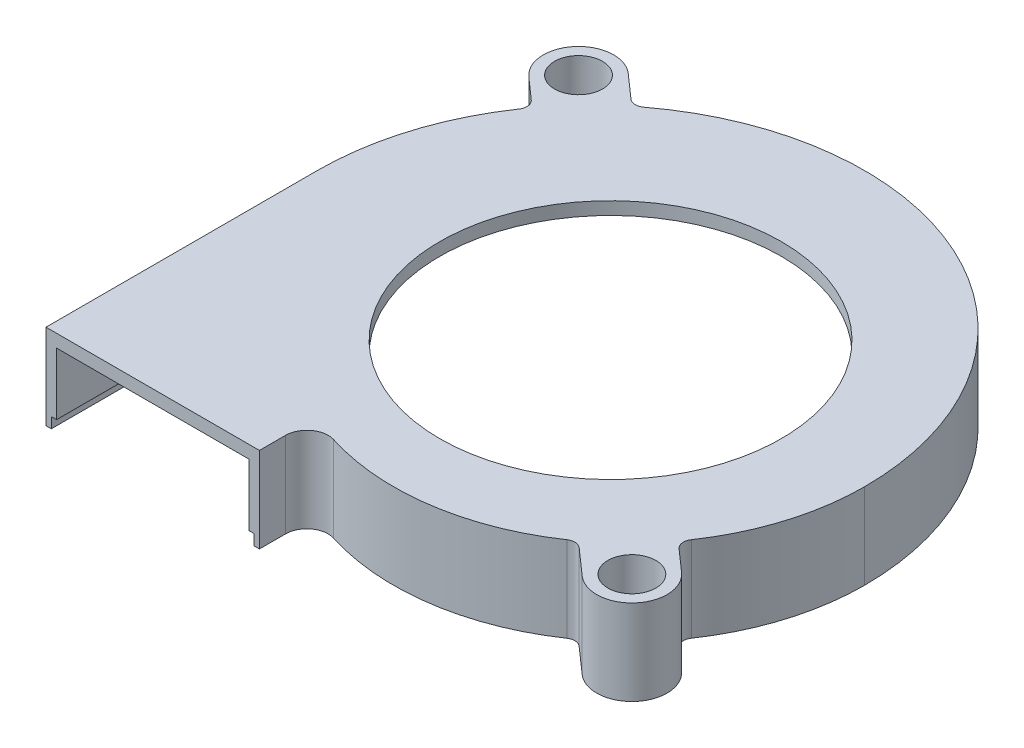
ISO-10303-21;
HEADER;
FILE_DESCRIPTION(('STEP AP214'),'2;1');
FILE_NAME('part.step','',(''),(''),'','','');
FILE_SCHEMA(('AUTOMOTIVE_DESIGN { 1 0 10303 214 1 1 1 1 }'));
ENDSEC;
DATA;
#1=APPLICATION_CONTEXT('core data for automotive mechanical design processes');
#2=APPLICATION_PROTOCOL_DEFINITION('international standard','automotive_design',2000,#1);
#3=PRODUCT_CONTEXT('',#1,'mechanical');
#4=PRODUCT('Part','Part','',(#3));
#5=PRODUCT_RELATED_PRODUCT_CATEGORY('part','',(#4));
#6=PRODUCT_DEFINITION_FORMATION('','',#4);
#7=PRODUCT_DEFINITION_CONTEXT('part definition',#1,'design');
#8=PRODUCT_DEFINITION('design','',#6,#7);
#9=PRODUCT_DEFINITION_SHAPE('','',#8);
#10=(LENGTH_UNIT() NAMED_UNIT(*) SI_UNIT(.MILLI.,.METRE.));
#11=(NAMED_UNIT(*) PLANE_ANGLE_UNIT() SI_UNIT($,.RADIAN.));
#12=(NAMED_UNIT(*) SI_UNIT($,.STERADIAN.) SOLID_ANGLE_UNIT());
#13=UNCERTAINTY_MEASURE_WITH_UNIT(LENGTH_MEASURE(1.E-05),#10,'distance_accuracy_value','');
#14=(GEOMETRIC_REPRESENTATION_CONTEXT(3) GLOBAL_UNCERTAINTY_ASSIGNED_CONTEXT((#13)) GLOBAL_UNIT_ASSIGNED_CONTEXT((#10,
#11,#12)) REPRESENTATION_CONTEXT('',''));
#15=CARTESIAN_POINT('',(0.,0.,0.));
#16=DIRECTION('',(0.,0.,1.));
#17=DIRECTION('',(1.,0.,0.));
#18=AXIS2_PLACEMENT_3D('',#15,#16,#17);
#19=CARTESIAN_POINT('',(-8.5,70.26503959981,25.4));
#20=DIRECTION('',(1.,0.,0.));
#21=DIRECTION('',(0.,0.,-1.));
#22=AXIS2_PLACEMENT_3D('',#19,#20,#21);
#23=PLANE('',#22);
#24=DIRECTION('',(0.,0.,-1.));
#25=VECTOR('',#24,1.);
#26=CARTESIAN_POINT('',(-8.5,-7.,22.9558491109208));
#27=LINE('',#26,#25);
#28=CARTESIAN_POINT('',(-8.5,-7.,25.4));
#29=VERTEX_POINT('',#28);
#30=CARTESIAN_POINT('',(-8.5,-7.,22.9558491109208));
#31=VERTEX_POINT('',#30);
#32=EDGE_CURVE('E587',#29,#31,#27,.T.);
#33=ORIENTED_EDGE('',*,*,#32,.F.);
#34=DIRECTION('',(0.,-1.,0.));
#35=VECTOR('',#34,1.);
#36=CARTESIAN_POINT('',(-8.5,70.26503959981,25.4));
#37=LINE('',#36,#35);
#38=CARTESIAN_POINT('',(-8.5,-1.20000000000001,25.4));
#39=VERTEX_POINT('',#38);
#40=EDGE_CURVE('E498',#39,#29,#37,.T.);
#41=ORIENTED_EDGE('',*,*,#40,.F.);
#42=DIRECTION('',(0.,0.,-1.));
#43=VECTOR('',#42,1.);
#44=CARTESIAN_POINT('',(-8.5,-1.20000000000001,25.4));
#45=LINE('',#44,#43);
#46=CARTESIAN_POINT('',(-8.49999999999999,-1.20000000000001,22.9558491109208));
#47=VERTEX_POINT('',#46);
#48=EDGE_CURVE('E590',#39,#47,#45,.T.);
#49=ORIENTED_EDGE('',*,*,#48,.T.);
#50=DIRECTION('',(0.,-1.,0.));
#51=VECTOR('',#50,1.);
#52=CARTESIAN_POINT('',(-8.5,70.26503959981,22.9558491109208));
#53=LINE('',#52,#51);
#54=EDGE_CURVE('E502',#47,#31,#53,.T.);
#55=ORIENTED_EDGE('',*,*,#54,.T.);
#56=EDGE_LOOP('',(#33,#41,#49,#55));
#57=FACE_BOUND('',#56,.T.);
#58=ADVANCED_FACE('F38',(#57),#23,.F.);
#59=CARTESIAN_POINT('',(-5.5,70.26503959981,22.9558491109208));
#60=DIRECTION('',(0.,-1.,0.));
#61=DIRECTION('',(0.,0.,-1.));
#62=AXIS2_PLACEMENT_3D('',#59,#60,#61);
#63=CYLINDRICAL_SURFACE('',#62,3.);
#64=CARTESIAN_POINT('',(-5.5,-7.,22.9558491109208));
#65=DIRECTION('',(0.,-1.,0.));
#66=DIRECTION('',(0.,0.,-1.));
#67=AXIS2_PLACEMENT_3D('',#64,#65,#66);
#68=CIRCLE('',#67,3.);
#69=CARTESIAN_POINT('',(-4.5985649942554,-7.,20.0944831905794));
#70=VERTEX_POINT('',#69);
#71=EDGE_CURVE('E576',#31,#70,#68,.T.);
#72=ORIENTED_EDGE('',*,*,#71,.F.);
#73=ORIENTED_EDGE('',*,*,#54,.F.);
#74=CARTESIAN_POINT('',(-5.5,-1.20000000000001,22.9558491109208));
#75=DIRECTION('',(0.,-1.,0.));
#76=DIRECTION('',(0.,0.,-1.));
#77=AXIS2_PLACEMENT_3D('',#74,#75,#76);
#78=CIRCLE('',#77,3.);
#79=CARTESIAN_POINT('',(-4.59856499423902,-1.20000000000001,20.0944831905274));
#80=VERTEX_POINT('',#79);
#81=EDGE_CURVE('E489',#47,#80,#78,.T.);
#82=ORIENTED_EDGE('',*,*,#81,.T.);
#83=DIRECTION('',(0.,-1.,0.));
#84=VECTOR('',#83,1.);
#85=CARTESIAN_POINT('',(-4.59856499423902,70.26503959981,20.0944831905274));
#86=LINE('',#85,#84);
#87=EDGE_CURVE('E486',#80,#70,#86,.T.);
#88=ORIENTED_EDGE('',*,*,#87,.T.);
#89=EDGE_LOOP('',(#72,#73,#82,#88));
#90=FACE_BOUND('',#89,.T.);
#91=ADVANCED_FACE('F307',(#90),#63,.T.);
#92=CARTESIAN_POINT('',(1.73193277310925,70.26503959981,0.));
#93=DIRECTION('',(0.,-1.,0.));
#94=DIRECTION('',(0.,0.,-1.));
#95=AXIS2_PLACEMENT_3D('',#92,#93,#94);
#96=CYLINDRICAL_SURFACE('',#95,21.0680672268908);
#97=CARTESIAN_POINT('',(1.73193277310925,-7.,0.));
#98=DIRECTION('',(0.,1.,0.));
#99=DIRECTION('',(0.,0.,-1.));
#100=AXIS2_PLACEMENT_3D('',#97,#98,#99);
#101=CIRCLE('',#100,21.0680672269453);
#102=CARTESIAN_POINT('',(22.800000024916,-7.,-0.000327043078988983));
#103=VERTEX_POINT('',#102);
#104=EDGE_CURVE('E603',#70,#103,#101,.T.);
#105=ORIENTED_EDGE('',*,*,#104,.F.);
#106=ORIENTED_EDGE('',*,*,#87,.F.);
#107=CARTESIAN_POINT('',(1.73193277310925,-1.20000000000001,0.));
#108=DIRECTION('',(0.,-1.,0.));
#109=DIRECTION('',(0.,0.,-1.));
#110=AXIS2_PLACEMENT_3D('',#107,#108,#109);
#111=CIRCLE('',#110,21.0680672268908);
#112=CARTESIAN_POINT('',(22.7999999974641,-1.20000000000001,-0.000326883642031274));
#113=VERTEX_POINT('',#112);
#114=EDGE_CURVE('E480',#80,#113,#111,.F.);
#115=ORIENTED_EDGE('',*,*,#114,.T.);
#116=DIRECTION('',(0.,-1.,0.));
#117=VECTOR('',#116,1.);
#118=CARTESIAN_POINT('',(22.7999999974641,70.26503959981,-0.000326883642031271));
#119=LINE('',#118,#117);
#120=EDGE_CURVE('E484',#113,#103,#119,.T.);
#121=ORIENTED_EDGE('',*,*,#120,.T.);
#122=EDGE_LOOP('',(#105,#106,#115,#121));
#123=FACE_BOUND('',#122,.T.);
#124=ADVANCED_FACE('F313',(#123),#96,.F.);
#125=CARTESIAN_POINT('',(-1.85,70.26503959981,-0.016796874999999));
#126=DIRECTION('',(0.,-1.,0.));
#127=DIRECTION('',(0.,0.,-1.));
#128=AXIS2_PLACEMENT_3D('',#125,#126,#127);
#129=CYLINDRICAL_SURFACE('',#128,24.6500054997072);
#130=CARTESIAN_POINT('',(-1.85,-7.,-0.016796874999999));
#131=DIRECTION('',(0.,1.,0.));
#132=DIRECTION('',(0.,0.,-1.));
#133=AXIS2_PLACEMENT_3D('',#130,#131,#132);
#134=CIRCLE('',#133,24.6500055270525);
#135=CARTESIAN_POINT('',(-26.5000000525161,-7.00000000000001,-0.000327424430267257));
#136=VERTEX_POINT('',#135);
#137=EDGE_CURVE('E55',#103,#136,#134,.T.);
#138=ORIENTED_EDGE('',*,*,#137,.F.);
#139=ORIENTED_EDGE('',*,*,#120,.F.);
#140=CARTESIAN_POINT('',(-1.85,-1.20000000000001,-0.016796874999999));
#141=DIRECTION('',(0.,-1.,0.));
#142=DIRECTION('',(0.,0.,-1.));
#143=AXIS2_PLACEMENT_3D('',#140,#141,#142);
#144=CIRCLE('',#143,24.6500054997072);
#145=CARTESIAN_POINT('',(-26.5000000525161,-1.20000000000001,-0.000327424430267257));
#146=VERTEX_POINT('',#145);
#147=EDGE_CURVE('E490',#113,#146,#144,.F.);
#148=ORIENTED_EDGE('',*,*,#147,.T.);
#149=DIRECTION('',(0.,-1.,0.));
#150=VECTOR('',#149,1.);
#151=CARTESIAN_POINT('',(-26.5000000525161,70.26503959981,-0.000327424430267257));
#152=LINE('',#151,#150);
#153=EDGE_CURVE('E500',#146,#136,#152,.T.);
#154=ORIENTED_EDGE('',*,*,#153,.T.);
#155=EDGE_LOOP('',(#138,#139,#148,#154));
#156=FACE_BOUND('',#155,.T.);
#157=ADVANCED_FACE('F323',(#156),#129,.F.);
#158=CARTESIAN_POINT('',(-26.5000001072067,70.26503959981,-0.000327424393735107));
#159=DIRECTION('',(-1.,0.,4.22068338812948E-09));
#160=DIRECTION('',(4.22068338812948E-09,0.,1.));
#161=AXIS2_PLACEMENT_3D('',#158,#159,#160);
#162=PLANE('',#161);
#163=DIRECTION('',(-4.28055939719574E-11,0.,1.));
#164=VECTOR('',#163,1.);
#165=CARTESIAN_POINT('',(-26.5000000536034,-7.,25.4));
#166=LINE('',#165,#164);
#167=CARTESIAN_POINT('',(-26.5000000536034,-7.,25.4));
#168=VERTEX_POINT('',#167);
#169=EDGE_CURVE('E608',#136,#168,#166,.T.);
#170=ORIENTED_EDGE('',*,*,#169,.F.);
#171=ORIENTED_EDGE('',*,*,#153,.F.);
#172=DIRECTION('',(4.22068338812948E-09,0.,1.));
#173=VECTOR('',#172,1.);
#174=CARTESIAN_POINT('',(-26.5000001072067,-1.20000000000001,-0.000327424393735107));
#175=LINE('',#174,#173);
#176=CARTESIAN_POINT('',(-26.5,-1.20000000000001,25.4));
#177=VERTEX_POINT('',#176);
#178=EDGE_CURVE('E495',#146,#177,#175,.T.);
#179=ORIENTED_EDGE('',*,*,#178,.T.);
#180=DIRECTION('',(0.,-1.,0.));
#181=VECTOR('',#180,1.);
#182=CARTESIAN_POINT('',(-26.5,70.26503959981,25.4));
#183=LINE('',#182,#181);
#184=EDGE_CURVE('E504',#177,#168,#183,.T.);
#185=ORIENTED_EDGE('',*,*,#184,.T.);
#186=EDGE_LOOP('',(#170,#171,#179,#185));
#187=FACE_BOUND('',#186,.T.);
#188=ADVANCED_FACE('F327',(#187),#162,.F.);
#189=CARTESIAN_POINT('',(0.,-8.,0.));
#190=DIRECTION('',(0.,1.,0.));
#191=DIRECTION('',(0.,0.,1.));
#192=AXIS2_PLACEMENT_3D('',#189,#190,#191);
#193=CYLINDRICAL_SURFACE('',#192,16.);
#194=CARTESIAN_POINT('',(0.,0.,0.));
#195=DIRECTION('',(0.,1.,0.));
#196=DIRECTION('',(0.,0.,1.));
#197=AXIS2_PLACEMENT_3D('',#194,#195,#196);
#198=CIRCLE('',#197,16.);
#199=CARTESIAN_POINT('',(0.,0.,16.));
#200=VERTEX_POINT('',#199);
#201=EDGE_CURVE('E351',#200,#200,#198,.T.);
#202=ORIENTED_EDGE('',*,*,#201,.T.);
#203=EDGE_LOOP('',(#202));
#204=FACE_BOUND('',#203,.T.);
#205=CARTESIAN_POINT('',(0.,-1.2,0.));
#206=DIRECTION('',(0.,-1.,0.));
#207=DIRECTION('',(0.,0.,-1.));
#208=AXIS2_PLACEMENT_3D('',#205,#206,#207);
#209=CIRCLE('',#208,16.);
#210=CARTESIAN_POINT('',(0.,-1.2,-16.));
#211=VERTEX_POINT('',#210);
#212=EDGE_CURVE('E42',#211,#211,#209,.F.);
#213=ORIENTED_EDGE('',*,*,#212,.F.);
#214=EDGE_LOOP('',(#213));
#215=FACE_BOUND('',#214,.T.);
#216=ADVANCED_FACE('F304',(#204,#215),#193,.F.);
#217=CARTESIAN_POINT('',(-23.,-8.,-20.));
#218=DIRECTION('',(0.,1.,0.));
#219=DIRECTION('',(0.,0.,1.));
#220=AXIS2_PLACEMENT_3D('',#217,#218,#219);
#221=CYLINDRICAL_SURFACE('',#220,3.3);
#222=CARTESIAN_POINT('',(-23.,0.,-20.));
#223=DIRECTION('',(0.,1.,0.));
#224=DIRECTION('',(0.,0.,-1.));
#225=AXIS2_PLACEMENT_3D('',#222,#223,#224);
#226=CIRCLE('',#225,3.3);
#227=CARTESIAN_POINT('',(-20.8147472716434,0.,-22.4727859820878));
#228=VERTEX_POINT('',#227);
#229=CARTESIAN_POINT('',(-25.1852527283566,0.,-17.5272140179122));
#230=VERTEX_POINT('',#229);
#231=EDGE_CURVE('E212',#228,#230,#226,.T.);
#232=ORIENTED_EDGE('',*,*,#231,.F.);
#233=DIRECTION('',(0.,1.,0.));
#234=VECTOR('',#233,1.);
#235=CARTESIAN_POINT('',(-20.8147472716434,-8.,-22.4727859820878));
#236=LINE('',#235,#234);
#237=CARTESIAN_POINT('',(-20.8147472716434,-8.,-22.4727859820878));
#238=VERTEX_POINT('',#237);
#239=EDGE_CURVE('E12',#238,#228,#236,.T.);
#240=ORIENTED_EDGE('',*,*,#239,.F.);
#241=CARTESIAN_POINT('',(-23.,-8.,-20.));
#242=DIRECTION('',(0.,1.,0.));
#243=DIRECTION('',(0.,0.,-1.));
#244=AXIS2_PLACEMENT_3D('',#241,#242,#243);
#245=CIRCLE('',#244,3.3);
#246=CARTESIAN_POINT('',(-25.1852527283566,-8.,-17.5272140179122));
#247=VERTEX_POINT('',#246);
#248=EDGE_CURVE('E263',#238,#247,#245,.T.);
#249=ORIENTED_EDGE('',*,*,#248,.T.);
#250=DIRECTION('',(0.,1.,0.));
#251=VECTOR('',#250,1.);
#252=CARTESIAN_POINT('',(-25.1852527283566,-8.,-17.5272140179122));
#253=LINE('',#252,#251);
#254=EDGE_CURVE('E131',#247,#230,#253,.T.);
#255=ORIENTED_EDGE('',*,*,#254,.T.);
#256=EDGE_LOOP('',(#232,#240,#249,#255));
#257=FACE_BOUND('',#256,.T.);
#258=ADVANCED_FACE('F40',(#257),#221,.T.);
#259=CARTESIAN_POINT('',(-20.8147472716434,-8.,-22.4727859820878));
#260=DIRECTION('',(0.66219779647171,0.,-0.749329085481147));
#261=DIRECTION('',(-0.749329085481147,0.,-0.66219779647171));
#262=AXIS2_PLACEMENT_3D('',#259,#260,#261);
#263=PLANE('',#262);
#264=DIRECTION('',(-0.749329085481147,0.,-0.66219779647171));
#265=VECTOR('',#264,1.);
#266=CARTESIAN_POINT('',(-20.8147472716434,0.,-22.4727859820878));
#267=LINE('',#266,#265);
#268=CARTESIAN_POINT('',(-18.5989053771657,0.,-20.5146001218517));
#269=VERTEX_POINT('',#268);
#270=EDGE_CURVE('E261',#269,#228,#267,.T.);
#271=ORIENTED_EDGE('',*,*,#270,.F.);
#272=DIRECTION('',(0.,1.,0.));
#273=VECTOR('',#272,1.);
#274=CARTESIAN_POINT('',(-18.5989053771657,-8.,-20.5146001218517));
#275=LINE('',#274,#273);
#276=CARTESIAN_POINT('',(-18.5989053771657,-8.,-20.5146001218517));
#277=VERTEX_POINT('',#276);
#278=EDGE_CURVE('E47',#277,#269,#275,.T.);
#279=ORIENTED_EDGE('',*,*,#278,.F.);
#280=DIRECTION('',(-0.749329085481147,0.,-0.66219779647171));
#281=VECTOR('',#280,1.);
#282=CARTESIAN_POINT('',(-20.8147472716434,-8.,-22.4727859820878));
#283=LINE('',#282,#281);
#284=EDGE_CURVE('E202',#277,#238,#283,.T.);
#285=ORIENTED_EDGE('',*,*,#284,.T.);
#286=ORIENTED_EDGE('',*,*,#239,.T.);
#287=EDGE_LOOP('',(#271,#279,#285,#286));
#288=FACE_BOUND('',#287,.T.);
#289=ADVANCED_FACE('F296',(#288),#263,.T.);
#290=CARTESIAN_POINT('',(-17.936707580694,-8.,-21.2639292073329));
#291=DIRECTION('',(0.,1.,0.));
#292=DIRECTION('',(0.,0.,1.));
#293=AXIS2_PLACEMENT_3D('',#290,#291,#292);
#294=CYLINDRICAL_SURFACE('',#293,1.);
#295=CARTESIAN_POINT('',(-17.936707580694,0.,-21.2639292073329));
#296=DIRECTION('',(0.,-1.,0.));
#297=DIRECTION('',(0.,0.,1.));
#298=AXIS2_PLACEMENT_3D('',#295,#296,#297);
#299=CIRCLE('',#298,1.);
#300=CARTESIAN_POINT('',(-17.3330789029862,0.,-20.4666636183045));
#301=VERTEX_POINT('',#300);
#302=EDGE_CURVE('E187',#301,#269,#299,.T.);
#303=ORIENTED_EDGE('',*,*,#302,.F.);
#304=DIRECTION('',(0.,1.,0.));
#305=VECTOR('',#304,1.);
#306=CARTESIAN_POINT('',(-17.3330789029862,-8.,-20.4666636183045));
#307=LINE('',#306,#305);
#308=CARTESIAN_POINT('',(-17.3330789029862,-8.,-20.4666636183045));
#309=VERTEX_POINT('',#308);
#310=EDGE_CURVE('E181',#309,#301,#307,.T.);
#311=ORIENTED_EDGE('',*,*,#310,.F.);
#312=CARTESIAN_POINT('',(-17.936707580694,-8.,-21.2639292073329));
#313=DIRECTION('',(0.,-1.,0.));
#314=DIRECTION('',(0.,0.,1.));
#315=AXIS2_PLACEMENT_3D('',#312,#313,#314);
#316=CIRCLE('',#315,1.);
#317=EDGE_CURVE('E184',#309,#277,#316,.T.);
#318=ORIENTED_EDGE('',*,*,#317,.T.);
#319=ORIENTED_EDGE('',*,*,#278,.T.);
#320=EDGE_LOOP('',(#303,#311,#318,#319));
#321=FACE_BOUND('',#320,.T.);
#322=ADVANCED_FACE('F183',(#321),#294,.F.);
#323=CARTESIAN_POINT('',(-1.85,-8.,-0.016796874999999));
#324=DIRECTION('',(0.,1.,0.));
#325=DIRECTION('',(0.,0.,1.));
#326=AXIS2_PLACEMENT_3D('',#323,#324,#325);
#327=CYLINDRICAL_SURFACE('',#326,25.6500054997072);
#328=CARTESIAN_POINT('',(-1.85,0.,-0.016796874999999));
#329=DIRECTION('',(0.,1.,0.));
#330=DIRECTION('',(0.,0.,1.));
#331=AXIS2_PLACEMENT_3D('',#328,#329,#330);
#332=CIRCLE('',#331,25.6500054997072);
#333=CARTESIAN_POINT('',(23.8,0.,0.));
#334=VERTEX_POINT('',#333);
#335=EDGE_CURVE('E258',#334,#301,#332,.T.);
#336=ORIENTED_EDGE('',*,*,#335,.F.);
#337=DIRECTION('',(0.,1.,0.));
#338=VECTOR('',#337,1.);
#339=CARTESIAN_POINT('',(23.8,-8.,0.));
#340=LINE('',#339,#338);
#341=CARTESIAN_POINT('',(23.8,-8.,0.));
#342=VERTEX_POINT('',#341);
#343=EDGE_CURVE('E192',#342,#334,#340,.T.);
#344=ORIENTED_EDGE('',*,*,#343,.F.);
#345=CARTESIAN_POINT('',(-1.85,-8.,-0.016796874999999));
#346=DIRECTION('',(0.,1.,0.));
#347=DIRECTION('',(0.,0.,1.));
#348=AXIS2_PLACEMENT_3D('',#345,#346,#347);
#349=CIRCLE('',#348,25.6500054997072);
#350=EDGE_CURVE('E200',#342,#309,#349,.T.);
#351=ORIENTED_EDGE('',*,*,#350,.T.);
#352=ORIENTED_EDGE('',*,*,#310,.T.);
#353=EDGE_LOOP('',(#336,#344,#351,#352));
#354=FACE_BOUND('',#353,.T.);
#355=ADVANCED_FACE('F204',(#354),#327,.T.);
#356=CARTESIAN_POINT('',(1.73193277310925,-8.,0.));
#357=DIRECTION('',(0.,1.,0.));
#358=DIRECTION('',(0.,0.,1.));
#359=AXIS2_PLACEMENT_3D('',#356,#357,#358);
#360=CYLINDRICAL_SURFACE('',#359,22.0680672268908);
#361=CARTESIAN_POINT('',(1.73193277310925,0.,0.));
#362=DIRECTION('',(0.,1.,0.));
#363=DIRECTION('',(0.,0.,-1.));
#364=AXIS2_PLACEMENT_3D('',#361,#362,#363);
#365=CIRCLE('',#364,22.0680672268908);
#366=CARTESIAN_POINT('',(19.9790752063348,0.,12.4113409489929));
#367=VERTEX_POINT('',#366);
#368=EDGE_CURVE('E255',#367,#334,#365,.T.);
#369=ORIENTED_EDGE('',*,*,#368,.F.);
#370=DIRECTION('',(0.,1.,0.));
#371=VECTOR('',#370,1.);
#372=CARTESIAN_POINT('',(19.9790752063348,-8.,12.4113409489929));
#373=LINE('',#372,#371);
#374=CARTESIAN_POINT('',(19.9790752063348,-8.,12.4113409489929));
#375=VERTEX_POINT('',#374);
#376=EDGE_CURVE('E267',#375,#367,#373,.T.);
#377=ORIENTED_EDGE('',*,*,#376,.F.);
#378=CARTESIAN_POINT('',(1.73193277310925,-8.,0.));
#379=DIRECTION('',(0.,1.,0.));
#380=DIRECTION('',(0.,0.,-1.));
#381=AXIS2_PLACEMENT_3D('',#378,#379,#380);
#382=CIRCLE('',#381,22.0680672268908);
#383=EDGE_CURVE('E205',#375,#342,#382,.T.);
#384=ORIENTED_EDGE('',*,*,#383,.T.);
#385=ORIENTED_EDGE('',*,*,#343,.T.);
#386=EDGE_LOOP('',(#369,#377,#384,#385));
#387=FACE_BOUND('',#386,.T.);
#388=ADVANCED_FACE('F666',(#387),#360,.T.);
#389=CARTESIAN_POINT('',(20.8059325040591,-8.,12.9737527280304));
#390=DIRECTION('',(0.,1.,0.));
#391=DIRECTION('',(0.,0.,1.));
#392=AXIS2_PLACEMENT_3D('',#389,#390,#391);
#393=CYLINDRICAL_SURFACE('',#392,1.);
#394=CARTESIAN_POINT('',(20.8059325040591,0.,12.9737527280304));
#395=DIRECTION('',(0.,-1.,0.));
#396=DIRECTION('',(0.,0.,-1.));
#397=AXIS2_PLACEMENT_3D('',#394,#395,#396);
#398=CIRCLE('',#397,1.);
#399=CARTESIAN_POINT('',(20.1437347075874,0.,13.7230818135115));
#400=VERTEX_POINT('',#399);
#401=EDGE_CURVE('E252',#400,#367,#398,.T.);
#402=ORIENTED_EDGE('',*,*,#401,.F.);
#403=DIRECTION('',(0.,1.,0.));
#404=VECTOR('',#403,1.);
#405=CARTESIAN_POINT('',(20.1437347075874,-8.,13.7230818135115));
#406=LINE('',#405,#404);
#407=CARTESIAN_POINT('',(20.1437347075874,-8.,13.7230818135115));
#408=VERTEX_POINT('',#407);
#409=EDGE_CURVE('E269',#408,#400,#406,.T.);
#410=ORIENTED_EDGE('',*,*,#409,.F.);
#411=CARTESIAN_POINT('',(20.8059325040591,-8.,12.9737527280304));
#412=DIRECTION('',(0.,-1.,0.));
#413=DIRECTION('',(0.,0.,-1.));
#414=AXIS2_PLACEMENT_3D('',#411,#412,#413);
#415=CIRCLE('',#414,1.);
#416=EDGE_CURVE('E207',#408,#375,#415,.T.);
#417=ORIENTED_EDGE('',*,*,#416,.T.);
#418=ORIENTED_EDGE('',*,*,#376,.T.);
#419=EDGE_LOOP('',(#402,#410,#417,#418));
#420=FACE_BOUND('',#419,.T.);
#421=ADVANCED_FACE('F408',(#420),#393,.F.);
#422=CARTESIAN_POINT('',(22.1852527283566,-8.,15.5272140179122));
#423=DIRECTION('',(0.66219779647171,0.,-0.749329085481147));
#424=DIRECTION('',(-0.749329085481147,0.,-0.66219779647171));
#425=AXIS2_PLACEMENT_3D('',#422,#423,#424);
#426=PLANE('',#425);
#427=DIRECTION('',(-0.749329085481146,0.,-0.66219779647171));
#428=VECTOR('',#427,1.);
#429=CARTESIAN_POINT('',(22.1852527283566,0.,15.5272140179122));
#430=LINE('',#429,#428);
#431=CARTESIAN_POINT('',(22.1852527283566,0.,15.5272140179122));
#432=VERTEX_POINT('',#431);
#433=EDGE_CURVE('E249',#432,#400,#430,.T.);
#434=ORIENTED_EDGE('',*,*,#433,.F.);
#435=DIRECTION('',(0.,1.,0.));
#436=VECTOR('',#435,1.);
#437=CARTESIAN_POINT('',(22.1852527283566,-8.,15.5272140179122));
#438=LINE('',#437,#436);
#439=CARTESIAN_POINT('',(22.1852527283566,-8.,15.5272140179122));
#440=VERTEX_POINT('',#439);
#441=EDGE_CURVE('E271',#440,#432,#438,.T.);
#442=ORIENTED_EDGE('',*,*,#441,.F.);
#443=DIRECTION('',(-0.749329085481146,0.,-0.66219779647171));
#444=VECTOR('',#443,1.);
#445=CARTESIAN_POINT('',(22.1852527283566,-8.,15.5272140179122));
#446=LINE('',#445,#444);
#447=EDGE_CURVE('E402',#440,#408,#446,.T.);
#448=ORIENTED_EDGE('',*,*,#447,.T.);
#449=ORIENTED_EDGE('',*,*,#409,.T.);
#450=EDGE_LOOP('',(#434,#442,#448,#449));
#451=FACE_BOUND('',#450,.T.);
#452=ADVANCED_FACE('F414',(#451),#426,.T.);
#453=CARTESIAN_POINT('',(20.,-8.,18.));
#454=DIRECTION('',(0.,1.,0.));
#455=DIRECTION('',(0.,0.,1.));
#456=AXIS2_PLACEMENT_3D('',#453,#454,#455);
#457=CYLINDRICAL_SURFACE('',#456,3.3);
#458=CARTESIAN_POINT('',(20.,0.,18.));
#459=DIRECTION('',(0.,1.,0.));
#460=DIRECTION('',(0.,0.,-1.));
#461=AXIS2_PLACEMENT_3D('',#458,#459,#460);
#462=CIRCLE('',#461,3.3);
#463=CARTESIAN_POINT('',(17.8147472716434,0.,20.4727859820878));
#464=VERTEX_POINT('',#463);
#465=EDGE_CURVE('E246',#464,#432,#462,.T.);
#466=ORIENTED_EDGE('',*,*,#465,.F.);
#467=DIRECTION('',(0.,1.,0.));
#468=VECTOR('',#467,1.);
#469=CARTESIAN_POINT('',(17.8147472716434,-8.,20.4727859820878));
#470=LINE('',#469,#468);
#471=CARTESIAN_POINT('',(17.8147472716434,-8.,20.4727859820878));
#472=VERTEX_POINT('',#471);
#473=EDGE_CURVE('E273',#472,#464,#470,.T.);
#474=ORIENTED_EDGE('',*,*,#473,.F.);
#475=CARTESIAN_POINT('',(20.,-8.,18.));
#476=DIRECTION('',(0.,1.,0.));
#477=DIRECTION('',(0.,0.,-1.));
#478=AXIS2_PLACEMENT_3D('',#475,#476,#477);
#479=CIRCLE('',#478,3.3);
#480=EDGE_CURVE('E399',#472,#440,#479,.T.);
#481=ORIENTED_EDGE('',*,*,#480,.T.);
#482=ORIENTED_EDGE('',*,*,#441,.T.);
#483=EDGE_LOOP('',(#466,#474,#481,#482));
#484=FACE_BOUND('',#483,.T.);
#485=ADVANCED_FACE('F417',(#484),#457,.T.);
#486=CARTESIAN_POINT('',(17.8147472716434,-8.,20.4727859820878));
#487=DIRECTION('',(-0.66219779647171,0.,0.749329085481147));
#488=DIRECTION('',(0.749329085481147,0.,0.66219779647171));
#489=AXIS2_PLACEMENT_3D('',#486,#487,#488);
#490=PLANE('',#489);
#491=DIRECTION('',(0.749329085481147,0.,0.66219779647171));
#492=VECTOR('',#491,1.);
#493=CARTESIAN_POINT('',(17.8147472716434,0.,20.4727859820878));
#494=LINE('',#493,#492);
#495=CARTESIAN_POINT('',(15.3769800356374,0.,18.3184800525942));
#496=VERTEX_POINT('',#495);
#497=EDGE_CURVE('E243',#496,#464,#494,.T.);
#498=ORIENTED_EDGE('',*,*,#497,.F.);
#499=DIRECTION('',(0.,1.,0.));
#500=VECTOR('',#499,1.);
#501=CARTESIAN_POINT('',(15.3769800356374,-8.,18.3184800525942));
#502=LINE('',#501,#500);
#503=CARTESIAN_POINT('',(15.3769800356374,-8.,18.3184800525942));
#504=VERTEX_POINT('',#503);
#505=EDGE_CURVE('E275',#504,#496,#502,.T.);
#506=ORIENTED_EDGE('',*,*,#505,.F.);
#507=DIRECTION('',(0.749329085481147,0.,0.66219779647171));
#508=VECTOR('',#507,1.);
#509=CARTESIAN_POINT('',(17.8147472716434,-8.,20.4727859820878));
#510=LINE('',#509,#508);
#511=EDGE_CURVE('E396',#504,#472,#510,.T.);
#512=ORIENTED_EDGE('',*,*,#511,.T.);
#513=ORIENTED_EDGE('',*,*,#473,.T.);
#514=EDGE_LOOP('',(#498,#506,#512,#513));
#515=FACE_BOUND('',#514,.T.);
#516=ADVANCED_FACE('F422',(#515),#490,.T.);
#517=CARTESIAN_POINT('',(14.7147822391657,-8.,19.0678091380753));
#518=DIRECTION('',(0.,1.,0.));
#519=DIRECTION('',(0.,0.,1.));
#520=AXIS2_PLACEMENT_3D('',#517,#518,#519);
#521=CYLINDRICAL_SURFACE('',#520,0.999999999999999);
#522=CARTESIAN_POINT('',(14.7147822391657,0.,19.0678091380753));
#523=DIRECTION('',(0.,-1.,0.));
#524=DIRECTION('',(0.,0.,1.));
#525=AXIS2_PLACEMENT_3D('',#522,#523,#524);
#526=CIRCLE('',#525,0.999999999999999);
#527=CARTESIAN_POINT('',(14.1519761168165,0.,18.2412202023604));
#528=VERTEX_POINT('',#527);
#529=EDGE_CURVE('E240',#528,#496,#526,.T.);
#530=ORIENTED_EDGE('',*,*,#529,.F.);
#531=DIRECTION('',(0.,1.,0.));
#532=VECTOR('',#531,1.);
#533=CARTESIAN_POINT('',(14.1519761168165,-8.,18.2412202023604));
#534=LINE('',#533,#532);
#535=CARTESIAN_POINT('',(14.1519761168165,-8.,18.2412202023604));
#536=VERTEX_POINT('',#535);
#537=EDGE_CURVE('E277',#536,#528,#534,.T.);
#538=ORIENTED_EDGE('',*,*,#537,.F.);
#539=CARTESIAN_POINT('',(14.7147822391657,-8.,19.0678091380753));
#540=DIRECTION('',(0.,-1.,0.));
#541=DIRECTION('',(0.,0.,1.));
#542=AXIS2_PLACEMENT_3D('',#539,#540,#541);
#543=CIRCLE('',#542,0.999999999999999);
#544=EDGE_CURVE('E393',#536,#504,#543,.T.);
#545=ORIENTED_EDGE('',*,*,#544,.T.);
#546=ORIENTED_EDGE('',*,*,#505,.T.);
#547=EDGE_LOOP('',(#530,#538,#545,#546));
#548=FACE_BOUND('',#547,.T.);
#549=ADVANCED_FACE('F425',(#548),#521,.F.);
#550=CARTESIAN_POINT('',(1.73193277310925,-8.,0.));
#551=DIRECTION('',(0.,1.,0.));
#552=DIRECTION('',(0.,0.,1.));
#553=AXIS2_PLACEMENT_3D('',#550,#551,#552);
#554=CYLINDRICAL_SURFACE('',#553,22.0680672268908);
#555=CARTESIAN_POINT('',(1.73193277310925,0.,0.));
#556=DIRECTION('',(0.,1.,0.));
#557=DIRECTION('',(0.,0.,-1.));
#558=AXIS2_PLACEMENT_3D('',#555,#556,#557);
#559=CIRCLE('',#558,22.0680672268908);
#560=CARTESIAN_POINT('',(-4.89904332949268,0.,21.0482718306585));
#561=VERTEX_POINT('',#560);
#562=EDGE_CURVE('E237',#561,#528,#559,.T.);
#563=ORIENTED_EDGE('',*,*,#562,.F.);
#564=DIRECTION('',(0.,1.,0.));
#565=VECTOR('',#564,1.);
#566=CARTESIAN_POINT('',(-4.89904332949268,-8.,21.0482718306585));
#567=LINE('',#566,#565);
#568=CARTESIAN_POINT('',(-4.89904332949268,-8.,21.0482718306585));
#569=VERTEX_POINT('',#568);
#570=EDGE_CURVE('E279',#569,#561,#567,.T.);
#571=ORIENTED_EDGE('',*,*,#570,.F.);
#572=CARTESIAN_POINT('',(1.73193277310925,-8.,0.));
#573=DIRECTION('',(0.,1.,0.));
#574=DIRECTION('',(0.,0.,-1.));
#575=AXIS2_PLACEMENT_3D('',#572,#573,#574);
#576=CIRCLE('',#575,22.0680672268908);
#577=EDGE_CURVE('E390',#569,#536,#576,.T.);
#578=ORIENTED_EDGE('',*,*,#577,.T.);
#579=ORIENTED_EDGE('',*,*,#537,.T.);
#580=EDGE_LOOP('',(#563,#571,#578,#579));
#581=FACE_BOUND('',#580,.T.);
#582=ADVANCED_FACE('F430',(#581),#554,.T.);
#583=CARTESIAN_POINT('',(-5.5,-8.,22.9558491109208));
#584=DIRECTION('',(0.,1.,0.));
#585=DIRECTION('',(0.,0.,1.));
#586=AXIS2_PLACEMENT_3D('',#583,#584,#585);
#587=CYLINDRICAL_SURFACE('',#586,2.);
#588=CARTESIAN_POINT('',(-5.5,0.,22.9558491109208));
#589=DIRECTION('',(0.,-1.,0.));
#590=DIRECTION('',(0.,0.,1.));
#591=AXIS2_PLACEMENT_3D('',#588,#589,#590);
#592=CIRCLE('',#591,2.);
#593=CARTESIAN_POINT('',(-7.5,0.,22.9558491109208));
#594=VERTEX_POINT('',#593);
#595=EDGE_CURVE('E234',#594,#561,#592,.T.);
#596=ORIENTED_EDGE('',*,*,#595,.F.);
#597=DIRECTION('',(0.,1.,0.));
#598=VECTOR('',#597,1.);
#599=CARTESIAN_POINT('',(-7.5,-8.,22.9558491109208));
#600=LINE('',#599,#598);
#601=CARTESIAN_POINT('',(-7.5,-8.,22.9558491109208));
#602=VERTEX_POINT('',#601);
#603=EDGE_CURVE('E281',#602,#594,#600,.T.);
#604=ORIENTED_EDGE('',*,*,#603,.F.);
#605=CARTESIAN_POINT('',(-5.5,-8.,22.9558491109208));
#606=DIRECTION('',(0.,-1.,0.));
#607=DIRECTION('',(0.,0.,1.));
#608=AXIS2_PLACEMENT_3D('',#605,#606,#607);
#609=CIRCLE('',#608,2.);
#610=EDGE_CURVE('E387',#602,#569,#609,.T.);
#611=ORIENTED_EDGE('',*,*,#610,.T.);
#612=ORIENTED_EDGE('',*,*,#570,.T.);
#613=EDGE_LOOP('',(#596,#604,#611,#612));
#614=FACE_BOUND('',#613,.T.);
#615=ADVANCED_FACE('F433',(#614),#587,.F.);
#616=CARTESIAN_POINT('',(-7.5,-8.,25.4));
#617=DIRECTION('',(1.,0.,0.));
#618=DIRECTION('',(0.,0.,-1.));
#619=AXIS2_PLACEMENT_3D('',#616,#617,#618);
#620=PLANE('',#619);
#621=DIRECTION('',(0.,0.,-1.));
#622=VECTOR('',#621,1.);
#623=CARTESIAN_POINT('',(-7.5,0.,25.4));
#624=LINE('',#623,#622);
#625=CARTESIAN_POINT('',(-7.5,0.,25.4));
#626=VERTEX_POINT('',#625);
#627=EDGE_CURVE('E231',#626,#594,#624,.T.);
#628=ORIENTED_EDGE('',*,*,#627,.F.);
#629=DIRECTION('',(0.,1.,0.));
#630=VECTOR('',#629,1.);
#631=CARTESIAN_POINT('',(-7.5,-8.,25.4));
#632=LINE('',#631,#630);
#633=CARTESIAN_POINT('',(-7.5,-8.,25.4));
#634=VERTEX_POINT('',#633);
#635=EDGE_CURVE('E283',#634,#626,#632,.T.);
#636=ORIENTED_EDGE('',*,*,#635,.F.);
#637=DIRECTION('',(0.,0.,-1.));
#638=VECTOR('',#637,1.);
#639=CARTESIAN_POINT('',(-7.5,-8.,25.4));
#640=LINE('',#639,#638);
#641=EDGE_CURVE('E384',#634,#602,#640,.T.);
#642=ORIENTED_EDGE('',*,*,#641,.T.);
#643=ORIENTED_EDGE('',*,*,#603,.T.);
#644=EDGE_LOOP('',(#628,#636,#642,#643));
#645=FACE_BOUND('',#644,.T.);
#646=ADVANCED_FACE('F439',(#645),#620,.T.);
#647=CARTESIAN_POINT('',(-27.5,-8.,25.4));
#648=DIRECTION('',(0.,0.,1.));
#649=DIRECTION('',(1.,0.,0.));
#650=AXIS2_PLACEMENT_3D('',#647,#648,#649);
#651=PLANE('',#650);
#652=DIRECTION('',(0.,-1.,0.));
#653=VECTOR('',#652,1.);
#654=CARTESIAN_POINT('',(-27.0000000525161,-7.,25.4));
#655=LINE('',#654,#653);
#656=CARTESIAN_POINT('',(-27.0000000525161,-7.,25.4));
#657=VERTEX_POINT('',#656);
#658=CARTESIAN_POINT('',(-27.0000000525161,-8.,25.4));
#659=VERTEX_POINT('',#658);
#660=EDGE_CURVE('E557',#657,#659,#655,.T.);
#661=ORIENTED_EDGE('',*,*,#660,.F.);
#662=DIRECTION('',(-1.,0.,0.));
#663=VECTOR('',#662,1.);
#664=CARTESIAN_POINT('',(-27.0000000525161,-7.,25.4));
#665=LINE('',#664,#663);
#666=EDGE_CURVE('E610',#168,#657,#665,.T.);
#667=ORIENTED_EDGE('',*,*,#666,.F.);
#668=ORIENTED_EDGE('',*,*,#184,.F.);
#669=DIRECTION('',(1.,0.,0.));
#670=VECTOR('',#669,1.);
#671=CARTESIAN_POINT('',(-26.5,-1.20000000000001,25.4));
#672=LINE('',#671,#670);
#673=EDGE_CURVE('E511',#177,#39,#672,.T.);
#674=ORIENTED_EDGE('',*,*,#673,.T.);
#675=ORIENTED_EDGE('',*,*,#40,.T.);
#676=DIRECTION('',(-1.,0.,0.));
#677=VECTOR('',#676,1.);
#678=CARTESIAN_POINT('',(-8.5,-7.,25.4));
#679=LINE('',#678,#677);
#680=CARTESIAN_POINT('',(-8.,-7.,25.4));
#681=VERTEX_POINT('',#680);
#682=EDGE_CURVE('E628',#681,#29,#679,.T.);
#683=ORIENTED_EDGE('',*,*,#682,.F.);
#684=DIRECTION('',(0.,-1.,0.));
#685=VECTOR('',#684,1.);
#686=CARTESIAN_POINT('',(-8.,-7.,25.4));
#687=LINE('',#686,#685);
#688=CARTESIAN_POINT('',(-8.,-8.,25.4));
#689=VERTEX_POINT('',#688);
#690=EDGE_CURVE('E448',#681,#689,#687,.T.);
#691=ORIENTED_EDGE('',*,*,#690,.T.);
#692=DIRECTION('',(1.,0.,0.));
#693=VECTOR('',#692,1.);
#694=CARTESIAN_POINT('',(-27.5,-8.,25.4));
#695=LINE('',#694,#693);
#696=EDGE_CURVE('E380',#689,#634,#695,.T.);
#697=ORIENTED_EDGE('',*,*,#696,.T.);
#698=ORIENTED_EDGE('',*,*,#635,.T.);
#699=DIRECTION('',(1.,0.,0.));
#700=VECTOR('',#699,1.);
#701=CARTESIAN_POINT('',(-27.5,0.,25.4));
#702=LINE('',#701,#700);
#703=CARTESIAN_POINT('',(-27.5,0.,25.4));
#704=VERTEX_POINT('',#703);
#705=EDGE_CURVE('E228',#704,#626,#702,.T.);
#706=ORIENTED_EDGE('',*,*,#705,.F.);
#707=DIRECTION('',(0.,1.,0.));
#708=VECTOR('',#707,1.);
#709=CARTESIAN_POINT('',(-27.5,-8.,25.4));
#710=LINE('',#709,#708);
#711=CARTESIAN_POINT('',(-27.5,-8.,25.4));
#712=VERTEX_POINT('',#711);
#713=EDGE_CURVE('E285',#712,#704,#710,.T.);
#714=ORIENTED_EDGE('',*,*,#713,.F.);
#715=EDGE_CURVE('E381',#712,#659,#695,.T.);
#716=ORIENTED_EDGE('',*,*,#715,.T.);
#717=EDGE_LOOP('',(#661,#667,#668,#674,#675,#683,#691,#697,#698,#706,#714,#716));
#718=FACE_BOUND('',#717,.T.);
#719=ADVANCED_FACE('F443',(#718),#651,.T.);
#720=CARTESIAN_POINT('',(-27.5,-8.,25.4));
#721=DIRECTION('',(-1.,0.,0.));
#722=DIRECTION('',(0.,0.,1.));
#723=AXIS2_PLACEMENT_3D('',#720,#721,#722);
#724=PLANE('',#723);
#725=DIRECTION('',(0.,0.,1.));
#726=VECTOR('',#725,1.);
#727=CARTESIAN_POINT('',(-27.5,0.,25.4));
#728=LINE('',#727,#726);
#729=CARTESIAN_POINT('',(-27.5,0.,0.));
#730=VERTEX_POINT('',#729);
#731=EDGE_CURVE('E225',#730,#704,#728,.T.);
#732=ORIENTED_EDGE('',*,*,#731,.F.);
#733=DIRECTION('',(0.,1.,0.));
#734=VECTOR('',#733,1.);
#735=CARTESIAN_POINT('',(-27.5,-8.,0.));
#736=LINE('',#735,#734);
#737=CARTESIAN_POINT('',(-27.5,-8.,0.));
#738=VERTEX_POINT('',#737);
#739=EDGE_CURVE('E287',#738,#730,#736,.T.);
#740=ORIENTED_EDGE('',*,*,#739,.F.);
#741=DIRECTION('',(0.,0.,1.));
#742=VECTOR('',#741,1.);
#743=CARTESIAN_POINT('',(-27.5,-8.,25.4));
#744=LINE('',#743,#742);
#745=EDGE_CURVE('E377',#738,#712,#744,.T.);
#746=ORIENTED_EDGE('',*,*,#745,.T.);
#747=ORIENTED_EDGE('',*,*,#713,.T.);
#748=EDGE_LOOP('',(#732,#740,#746,#747));
#749=FACE_BOUND('',#748,.T.);
#750=ADVANCED_FACE('F658',(#749),#724,.T.);
#751=CARTESIAN_POINT('',(-1.85,-8.,-0.016796874999999));
#752=DIRECTION('',(0.,1.,0.));
#753=DIRECTION('',(0.,0.,1.));
#754=AXIS2_PLACEMENT_3D('',#751,#752,#753);
#755=CYLINDRICAL_SURFACE('',#754,25.6500054997072);
#756=CARTESIAN_POINT('',(-1.85,0.,-0.016796874999999));
#757=DIRECTION('',(0.,1.,0.));
#758=DIRECTION('',(0.,0.,1.));
#759=AXIS2_PLACEMENT_3D('',#756,#757,#758);
#760=CIRCLE('',#759,25.6500054997072);
#761=CARTESIAN_POINT('',(-23.0428472901912,0.,-14.4662261325744));
#762=VERTEX_POINT('',#761);
#763=EDGE_CURVE('E222',#762,#730,#760,.T.);
#764=ORIENTED_EDGE('',*,*,#763,.F.);
#765=DIRECTION('',(0.,1.,0.));
#766=VECTOR('',#765,1.);
#767=CARTESIAN_POINT('',(-23.0428472901912,-8.,-14.4662261325744));
#768=LINE('',#767,#766);
#769=CARTESIAN_POINT('',(-23.0428472901912,-8.,-14.4662261325744));
#770=VERTEX_POINT('',#769);
#771=EDGE_CURVE('E289',#770,#762,#768,.T.);
#772=ORIENTED_EDGE('',*,*,#771,.F.);
#773=CARTESIAN_POINT('',(-1.85,-8.,-0.016796874999999));
#774=DIRECTION('',(0.,1.,0.));
#775=DIRECTION('',(0.,0.,1.));
#776=AXIS2_PLACEMENT_3D('',#773,#774,#775);
#777=CIRCLE('',#776,25.6500054997072);
#778=EDGE_CURVE('E374',#770,#738,#777,.T.);
#779=ORIENTED_EDGE('',*,*,#778,.T.);
#780=ORIENTED_EDGE('',*,*,#739,.T.);
#781=EDGE_LOOP('',(#764,#772,#779,#780));
#782=FACE_BOUND('',#781,.T.);
#783=ADVANCED_FACE('F661',(#782),#755,.T.);
#784=CARTESIAN_POINT('',(-23.8690789762013,-8.,-15.0295565871327));
#785=DIRECTION('',(0.,1.,0.));
#786=DIRECTION('',(0.,0.,1.));
#787=AXIS2_PLACEMENT_3D('',#784,#785,#786);
#788=CYLINDRICAL_SURFACE('',#787,1.);
#789=CARTESIAN_POINT('',(-23.8690789762013,0.,-15.0295565871327));
#790=DIRECTION('',(0.,-1.,0.));
#791=DIRECTION('',(0.,0.,-1.));
#792=AXIS2_PLACEMENT_3D('',#789,#790,#791);
#793=CIRCLE('',#792,1.);
#794=CARTESIAN_POINT('',(-23.2068811797296,0.,-15.7788856726139));
#795=VERTEX_POINT('',#794);
#796=EDGE_CURVE('E219',#795,#762,#793,.T.);
#797=ORIENTED_EDGE('',*,*,#796,.F.);
#798=DIRECTION('',(0.,1.,0.));
#799=VECTOR('',#798,1.);
#800=CARTESIAN_POINT('',(-23.2068811797296,-8.,-15.7788856726139));
#801=LINE('',#800,#799);
#802=CARTESIAN_POINT('',(-23.2068811797296,-8.,-15.7788856726139));
#803=VERTEX_POINT('',#802);
#804=EDGE_CURVE('E291',#803,#795,#801,.T.);
#805=ORIENTED_EDGE('',*,*,#804,.F.);
#806=CARTESIAN_POINT('',(-23.8690789762013,-8.,-15.0295565871327));
#807=DIRECTION('',(0.,-1.,0.));
#808=DIRECTION('',(0.,0.,-1.));
#809=AXIS2_PLACEMENT_3D('',#806,#807,#808);
#810=CIRCLE('',#809,1.);
#811=EDGE_CURVE('E371',#803,#770,#810,.T.);
#812=ORIENTED_EDGE('',*,*,#811,.T.);
#813=ORIENTED_EDGE('',*,*,#771,.T.);
#814=EDGE_LOOP('',(#797,#805,#812,#813));
#815=FACE_BOUND('',#814,.T.);
#816=ADVANCED_FACE('F664',(#815),#788,.F.);
#817=CARTESIAN_POINT('',(-25.1852527283566,-8.,-17.5272140179122));
#818=DIRECTION('',(-0.662197796471712,0.,0.749329085481145));
#819=DIRECTION('',(0.749329085481145,0.,0.662197796471712));
#820=AXIS2_PLACEMENT_3D('',#817,#818,#819);
#821=PLANE('',#820);
#822=DIRECTION('',(0.749329085481145,0.,0.662197796471712));
#823=VECTOR('',#822,1.);
#824=CARTESIAN_POINT('',(-25.1852527283566,0.,-17.5272140179122));
#825=LINE('',#824,#823);
#826=EDGE_CURVE('E215',#230,#795,#825,.T.);
#827=ORIENTED_EDGE('',*,*,#826,.F.);
#828=ORIENTED_EDGE('',*,*,#254,.F.);
#829=DIRECTION('',(0.749329085481145,0.,0.662197796471712));
#830=VECTOR('',#829,1.);
#831=CARTESIAN_POINT('',(-25.1852527283566,-8.,-17.5272140179122));
#832=LINE('',#831,#830);
#833=EDGE_CURVE('E369',#247,#803,#832,.T.);
#834=ORIENTED_EDGE('',*,*,#833,.T.);
#835=ORIENTED_EDGE('',*,*,#804,.T.);
#836=EDGE_LOOP('',(#827,#828,#834,#835));
#837=FACE_BOUND('',#836,.T.);
#838=ADVANCED_FACE('F292',(#837),#821,.T.);
#839=CARTESIAN_POINT('',(-23.,-8.,-20.));
#840=DIRECTION('',(0.,-1.,0.));
#841=DIRECTION('',(0.,0.,-1.));
#842=AXIS2_PLACEMENT_3D('',#839,#840,#841);
#843=PLANE('',#842);
#844=DIRECTION('',(0.,0.,1.));
#845=VECTOR('',#844,1.);
#846=CARTESIAN_POINT('',(-7.99999999999999,-8.,22.9558491109208));
#847=LINE('',#846,#845);
#848=CARTESIAN_POINT('',(-7.99999999999999,-8.,22.9558491109208));
#849=VERTEX_POINT('',#848);
#850=EDGE_CURVE('E452',#849,#689,#847,.T.);
#851=ORIENTED_EDGE('',*,*,#850,.F.);
#852=CARTESIAN_POINT('',(-5.5,-8.,22.9558491109208));
#853=DIRECTION('',(0.,1.,0.));
#854=DIRECTION('',(0.,0.,-1.));
#855=AXIS2_PLACEMENT_3D('',#852,#853,#854);
#856=CIRCLE('',#855,2.5);
#857=CARTESIAN_POINT('',(-4.74880416186585,-8.,20.5713775105929));
#858=VERTEX_POINT('',#857);
#859=EDGE_CURVE('E569',#858,#849,#856,.T.);
#860=ORIENTED_EDGE('',*,*,#859,.F.);
#861=CARTESIAN_POINT('',(1.73193277310925,-8.,0.));
#862=DIRECTION('',(0.,-1.,0.));
#863=DIRECTION('',(0.,0.,-1.));
#864=AXIS2_PLACEMENT_3D('',#861,#862,#863);
#865=CIRCLE('',#864,21.5680672268908);
#866=CARTESIAN_POINT('',(23.299999999651,-8.,-0.000122693548603174));
#867=VERTEX_POINT('',#866);
#868=EDGE_CURVE('E566',#867,#858,#865,.T.);
#869=ORIENTED_EDGE('',*,*,#868,.F.);
#870=CARTESIAN_POINT('',(-1.85,-8.,-0.016796874999999));
#871=DIRECTION('',(0.,-1.,0.));
#872=DIRECTION('',(0.,0.,-1.));
#873=AXIS2_PLACEMENT_3D('',#870,#871,#872);
#874=CIRCLE('',#873,25.1500055062662);
#875=CARTESIAN_POINT('',(-27.0000000038298,-8.,-0.000160391496041035));
#876=VERTEX_POINT('',#875);
#877=EDGE_CURVE('E561',#876,#867,#874,.T.);
#878=ORIENTED_EDGE('',*,*,#877,.F.);
#879=DIRECTION('',(2.73512697014853E-09,0.,-1.));
#880=VECTOR('',#879,1.);
#881=CARTESIAN_POINT('',(-27.0000000525161,-8.,25.4));
#882=LINE('',#881,#880);
#883=EDGE_CURVE('E549',#659,#876,#882,.T.);
#884=ORIENTED_EDGE('',*,*,#883,.F.);
#885=ORIENTED_EDGE('',*,*,#715,.F.);
#886=ORIENTED_EDGE('',*,*,#745,.F.);
#887=ORIENTED_EDGE('',*,*,#778,.F.);
#888=ORIENTED_EDGE('',*,*,#811,.F.);
#889=ORIENTED_EDGE('',*,*,#833,.F.);
#890=ORIENTED_EDGE('',*,*,#248,.F.);
#891=ORIENTED_EDGE('',*,*,#284,.F.);
#892=ORIENTED_EDGE('',*,*,#317,.F.);
#893=ORIENTED_EDGE('',*,*,#350,.F.);
#894=ORIENTED_EDGE('',*,*,#383,.F.);
#895=ORIENTED_EDGE('',*,*,#416,.F.);
#896=ORIENTED_EDGE('',*,*,#447,.F.);
#897=ORIENTED_EDGE('',*,*,#480,.F.);
#898=ORIENTED_EDGE('',*,*,#511,.F.);
#899=ORIENTED_EDGE('',*,*,#544,.F.);
#900=ORIENTED_EDGE('',*,*,#577,.F.);
#901=ORIENTED_EDGE('',*,*,#610,.F.);
#902=ORIENTED_EDGE('',*,*,#641,.F.);
#903=ORIENTED_EDGE('',*,*,#696,.F.);
#904=EDGE_LOOP('',(#851,#860,#869,#878,#884,#885,#886,#887,#888,#889,#890,#891,#892,#893,#894,
#895,#896,#897,#898,#899,#900,#901,#902,#903));
#905=FACE_BOUND('',#904,.T.);
#906=CARTESIAN_POINT('',(20.,-8.,18.));
#907=DIRECTION('',(0.,1.,0.));
#908=DIRECTION('',(0.,0.,1.));
#909=AXIS2_PLACEMENT_3D('',#906,#907,#908);
#910=CIRCLE('',#909,2.25);
#911=CARTESIAN_POINT('',(20.,-8.,20.25));
#912=VERTEX_POINT('',#911);
#913=EDGE_CURVE('E360',#912,#912,#910,.T.);
#914=ORIENTED_EDGE('',*,*,#913,.T.);
#915=EDGE_LOOP('',(#914));
#916=FACE_BOUND('',#915,.T.);
#917=CARTESIAN_POINT('',(-23.,-8.,-20.));
#918=DIRECTION('',(0.,1.,0.));
#919=DIRECTION('',(0.,0.,1.));
#920=AXIS2_PLACEMENT_3D('',#917,#918,#919);
#921=CIRCLE('',#920,2.25);
#922=CARTESIAN_POINT('',(-23.,-8.,-17.75));
#923=VERTEX_POINT('',#922);
#924=EDGE_CURVE('E216',#923,#923,#921,.T.);
#925=ORIENTED_EDGE('',*,*,#924,.T.);
#926=EDGE_LOOP('',(#925));
#927=FACE_BOUND('',#926,.T.);
#928=ADVANCED_FACE('F197',(#905,#916,#927),#843,.T.);
#929=CARTESIAN_POINT('',(-23.,0.,-20.));
#930=DIRECTION('',(0.,-1.,0.));
#931=DIRECTION('',(0.,0.,-1.));
#932=AXIS2_PLACEMENT_3D('',#929,#930,#931);
#933=PLANE('',#932);
#934=ORIENTED_EDGE('',*,*,#201,.F.);
#935=EDGE_LOOP('',(#934));
#936=FACE_BOUND('',#935,.T.);
#937=CARTESIAN_POINT('',(20.,0.,18.));
#938=DIRECTION('',(0.,1.,0.));
#939=DIRECTION('',(0.,0.,1.));
#940=AXIS2_PLACEMENT_3D('',#937,#938,#939);
#941=CIRCLE('',#940,2.25);
#942=CARTESIAN_POINT('',(20.,0.,20.25));
#943=VERTEX_POINT('',#942);
#944=EDGE_CURVE('E355',#943,#943,#941,.T.);
#945=ORIENTED_EDGE('',*,*,#944,.F.);
#946=EDGE_LOOP('',(#945));
#947=FACE_BOUND('',#946,.T.);
#948=CARTESIAN_POINT('',(-23.,0.,-20.));
#949=DIRECTION('',(0.,1.,0.));
#950=DIRECTION('',(0.,0.,1.));
#951=AXIS2_PLACEMENT_3D('',#948,#949,#950);
#952=CIRCLE('',#951,2.25);
#953=CARTESIAN_POINT('',(-23.,0.,-17.75));
#954=VERTEX_POINT('',#953);
#955=EDGE_CURVE('E358',#954,#954,#952,.T.);
#956=ORIENTED_EDGE('',*,*,#955,.F.);
#957=EDGE_LOOP('',(#956));
#958=FACE_BOUND('',#957,.T.);
#959=ORIENTED_EDGE('',*,*,#231,.T.);
#960=ORIENTED_EDGE('',*,*,#826,.T.);
#961=ORIENTED_EDGE('',*,*,#796,.T.);
#962=ORIENTED_EDGE('',*,*,#763,.T.);
#963=ORIENTED_EDGE('',*,*,#731,.T.);
#964=ORIENTED_EDGE('',*,*,#705,.T.);
#965=ORIENTED_EDGE('',*,*,#627,.T.);
#966=ORIENTED_EDGE('',*,*,#595,.T.);
#967=ORIENTED_EDGE('',*,*,#562,.T.);
#968=ORIENTED_EDGE('',*,*,#529,.T.);
#969=ORIENTED_EDGE('',*,*,#497,.T.);
#970=ORIENTED_EDGE('',*,*,#465,.T.);
#971=ORIENTED_EDGE('',*,*,#433,.T.);
#972=ORIENTED_EDGE('',*,*,#401,.T.);
#973=ORIENTED_EDGE('',*,*,#368,.T.);
#974=ORIENTED_EDGE('',*,*,#335,.T.);
#975=ORIENTED_EDGE('',*,*,#302,.T.);
#976=ORIENTED_EDGE('',*,*,#270,.T.);
#977=EDGE_LOOP('',(#959,#960,#961,#962,#963,#964,#965,#966,#967,#968,#969,#970,#971,#972,#973,
#974,#975,#976));
#978=FACE_BOUND('',#977,.T.);
#979=ADVANCED_FACE('F295',(#936,#947,#958,#978),#933,.F.);
#980=CARTESIAN_POINT('',(-23.,-8.,-20.));
#981=DIRECTION('',(0.,1.,0.));
#982=DIRECTION('',(0.,0.,1.));
#983=AXIS2_PLACEMENT_3D('',#980,#981,#982);
#984=CYLINDRICAL_SURFACE('',#983,2.25);
#985=ORIENTED_EDGE('',*,*,#924,.F.);
#986=EDGE_LOOP('',(#985));
#987=FACE_BOUND('',#986,.T.);
#988=ORIENTED_EDGE('',*,*,#955,.T.);
#989=EDGE_LOOP('',(#988));
#990=FACE_BOUND('',#989,.T.);
#991=ADVANCED_FACE('F338',(#987,#990),#984,.F.);
#992=CARTESIAN_POINT('',(20.,-8.,18.));
#993=DIRECTION('',(0.,1.,0.));
#994=DIRECTION('',(0.,0.,1.));
#995=AXIS2_PLACEMENT_3D('',#992,#993,#994);
#996=CYLINDRICAL_SURFACE('',#995,2.25);
#997=ORIENTED_EDGE('',*,*,#913,.F.);
#998=EDGE_LOOP('',(#997));
#999=FACE_BOUND('',#998,.T.);
#1000=ORIENTED_EDGE('',*,*,#944,.T.);
#1001=EDGE_LOOP('',(#1000));
#1002=FACE_BOUND('',#1001,.T.);
#1003=ADVANCED_FACE('F335',(#999,#1002),#996,.F.);
#1004=CARTESIAN_POINT('',(-23.,-1.2,-20.));
#1005=DIRECTION('',(0.,-1.,0.));
#1006=DIRECTION('',(0.,0.,-1.));
#1007=AXIS2_PLACEMENT_3D('',#1004,#1005,#1006);
#1008=PLANE('',#1007);
#1009=ORIENTED_EDGE('',*,*,#673,.F.);
#1010=ORIENTED_EDGE('',*,*,#178,.F.);
#1011=ORIENTED_EDGE('',*,*,#147,.F.);
#1012=ORIENTED_EDGE('',*,*,#114,.F.);
#1013=ORIENTED_EDGE('',*,*,#81,.F.);
#1014=ORIENTED_EDGE('',*,*,#48,.F.);
#1015=EDGE_LOOP('',(#1009,#1010,#1011,#1012,#1013,#1014));
#1016=FACE_BOUND('',#1015,.T.);
#1017=ORIENTED_EDGE('',*,*,#212,.T.);
#1018=EDGE_LOOP('',(#1017));
#1019=FACE_BOUND('',#1018,.T.);
#1020=ADVANCED_FACE('F318',(#1016,#1019),#1008,.T.);
#1021=CARTESIAN_POINT('',(-7.99999999999999,-7.,22.9558491109208));
#1022=DIRECTION('',(1.,0.,0.));
#1023=DIRECTION('',(0.,0.,-1.));
#1024=AXIS2_PLACEMENT_3D('',#1021,#1022,#1023);
#1025=PLANE('',#1024);
#1026=ORIENTED_EDGE('',*,*,#850,.T.);
#1027=ORIENTED_EDGE('',*,*,#690,.F.);
#1028=DIRECTION('',(0.,0.,1.));
#1029=VECTOR('',#1028,1.);
#1030=CARTESIAN_POINT('',(-7.99999999999999,-7.,22.9558491109208));
#1031=LINE('',#1030,#1029);
#1032=CARTESIAN_POINT('',(-7.99999999999999,-7.,22.9558491109208));
#1033=VERTEX_POINT('',#1032);
#1034=EDGE_CURVE('E625',#1033,#681,#1031,.T.);
#1035=ORIENTED_EDGE('',*,*,#1034,.F.);
#1036=DIRECTION('',(0.,-1.,0.));
#1037=VECTOR('',#1036,1.);
#1038=CARTESIAN_POINT('',(-7.99999999999999,-7.,22.9558491109208));
#1039=LINE('',#1038,#1037);
#1040=EDGE_CURVE('E578',#1033,#849,#1039,.T.);
#1041=ORIENTED_EDGE('',*,*,#1040,.T.);
#1042=EDGE_LOOP('',(#1026,#1027,#1035,#1041));
#1043=FACE_BOUND('',#1042,.T.);
#1044=ADVANCED_FACE('F517',(#1043),#1025,.F.);
#1045=CARTESIAN_POINT('',(-5.5,-7.,22.9558491109208));
#1046=DIRECTION('',(0.,-1.,0.));
#1047=DIRECTION('',(0.,0.,-1.));
#1048=AXIS2_PLACEMENT_3D('',#1045,#1046,#1047);
#1049=CYLINDRICAL_SURFACE('',#1048,2.5);
#1050=ORIENTED_EDGE('',*,*,#859,.T.);
#1051=ORIENTED_EDGE('',*,*,#1040,.F.);
#1052=CARTESIAN_POINT('',(-5.5,-7.,22.9558491109208));
#1053=DIRECTION('',(0.,1.,0.));
#1054=DIRECTION('',(0.,0.,-1.));
#1055=AXIS2_PLACEMENT_3D('',#1052,#1053,#1054);
#1056=CIRCLE('',#1055,2.5);
#1057=CARTESIAN_POINT('',(-4.74880416186585,-7.,20.5713775105929));
#1058=VERTEX_POINT('',#1057);
#1059=EDGE_CURVE('E622',#1058,#1033,#1056,.T.);
#1060=ORIENTED_EDGE('',*,*,#1059,.F.);
#1061=DIRECTION('',(0.,-1.,0.));
#1062=VECTOR('',#1061,1.);
#1063=CARTESIAN_POINT('',(-4.74880416186585,-7.,20.5713775105929));
#1064=LINE('',#1063,#1062);
#1065=EDGE_CURVE('E580',#1058,#858,#1064,.T.);
#1066=ORIENTED_EDGE('',*,*,#1065,.T.);
#1067=EDGE_LOOP('',(#1050,#1051,#1060,#1066));
#1068=FACE_BOUND('',#1067,.T.);
#1069=ADVANCED_FACE('F521',(#1068),#1049,.T.);
#1070=CARTESIAN_POINT('',(1.73193277310925,-7.,0.));
#1071=DIRECTION('',(0.,-1.,0.));
#1072=DIRECTION('',(0.,0.,-1.));
#1073=AXIS2_PLACEMENT_3D('',#1070,#1071,#1072);
#1074=CYLINDRICAL_SURFACE('',#1073,21.5680672268908);
#1075=ORIENTED_EDGE('',*,*,#868,.T.);
#1076=ORIENTED_EDGE('',*,*,#1065,.F.);
#1077=CARTESIAN_POINT('',(1.73193277310925,-7.,0.));
#1078=DIRECTION('',(0.,-1.,0.));
#1079=DIRECTION('',(0.,0.,-1.));
#1080=AXIS2_PLACEMENT_3D('',#1077,#1078,#1079);
#1081=CIRCLE('',#1080,21.5680672268908);
#1082=CARTESIAN_POINT('',(23.299999999651,-7.,-0.000122693548603174));
#1083=VERTEX_POINT('',#1082);
#1084=EDGE_CURVE('E619',#1083,#1058,#1081,.T.);
#1085=ORIENTED_EDGE('',*,*,#1084,.F.);
#1086=DIRECTION('',(0.,-1.,0.));
#1087=VECTOR('',#1086,1.);
#1088=CARTESIAN_POINT('',(23.299999999651,-7.,-0.000122693548603174));
#1089=LINE('',#1088,#1087);
#1090=EDGE_CURVE('E583',#1083,#867,#1089,.T.);
#1091=ORIENTED_EDGE('',*,*,#1090,.T.);
#1092=EDGE_LOOP('',(#1075,#1076,#1085,#1091));
#1093=FACE_BOUND('',#1092,.T.);
#1094=ADVANCED_FACE('F526',(#1093),#1074,.F.);
#1095=CARTESIAN_POINT('',(-1.85,-7.,-0.016796874999999));
#1096=DIRECTION('',(0.,-1.,0.));
#1097=DIRECTION('',(0.,0.,-1.));
#1098=AXIS2_PLACEMENT_3D('',#1095,#1096,#1097);
#1099=CYLINDRICAL_SURFACE('',#1098,25.1500055062662);
#1100=ORIENTED_EDGE('',*,*,#877,.T.);
#1101=ORIENTED_EDGE('',*,*,#1090,.F.);
#1102=CARTESIAN_POINT('',(-1.85,-7.,-0.016796874999999));
#1103=DIRECTION('',(0.,-1.,0.));
#1104=DIRECTION('',(0.,0.,-1.));
#1105=AXIS2_PLACEMENT_3D('',#1102,#1103,#1104);
#1106=CIRCLE('',#1105,25.1500055062662);
#1107=CARTESIAN_POINT('',(-27.0000000038298,-7.,-0.000160391496041035));
#1108=VERTEX_POINT('',#1107);
#1109=EDGE_CURVE('E616',#1108,#1083,#1106,.T.);
#1110=ORIENTED_EDGE('',*,*,#1109,.F.);
#1111=DIRECTION('',(0.,-1.,0.));
#1112=VECTOR('',#1111,1.);
#1113=CARTESIAN_POINT('',(-27.0000000038298,-7.,-0.000160391496041035));
#1114=LINE('',#1113,#1112);
#1115=EDGE_CURVE('E554',#1108,#876,#1114,.T.);
#1116=ORIENTED_EDGE('',*,*,#1115,.T.);
#1117=EDGE_LOOP('',(#1100,#1101,#1110,#1116));
#1118=FACE_BOUND('',#1117,.T.);
#1119=ADVANCED_FACE('F534',(#1118),#1099,.F.);
#1120=CARTESIAN_POINT('',(-27.0000000525161,-7.,25.4));
#1121=DIRECTION('',(-1.,0.,-2.73512697014853E-09));
#1122=DIRECTION('',(-2.73512697014853E-09,0.,1.));
#1123=AXIS2_PLACEMENT_3D('',#1120,#1121,#1122);
#1124=PLANE('',#1123);
#1125=ORIENTED_EDGE('',*,*,#883,.T.);
#1126=ORIENTED_EDGE('',*,*,#1115,.F.);
#1127=DIRECTION('',(2.73512697014853E-09,0.,-1.));
#1128=VECTOR('',#1127,1.);
#1129=CARTESIAN_POINT('',(-27.0000000525161,-7.,25.4));
#1130=LINE('',#1129,#1128);
#1131=EDGE_CURVE('E613',#657,#1108,#1130,.T.);
#1132=ORIENTED_EDGE('',*,*,#1131,.F.);
#1133=ORIENTED_EDGE('',*,*,#660,.T.);
#1134=EDGE_LOOP('',(#1125,#1126,#1132,#1133));
#1135=FACE_BOUND('',#1134,.T.);
#1136=ADVANCED_FACE('F537',(#1135),#1124,.F.);
#1137=CARTESIAN_POINT('',(-5.5,-7.,22.9558491109208));
#1138=DIRECTION('',(0.,-1.,0.));
#1139=DIRECTION('',(0.,0.,-1.));
#1140=AXIS2_PLACEMENT_3D('',#1137,#1138,#1139);
#1141=PLANE('',#1140);
#1142=ORIENTED_EDGE('',*,*,#71,.T.);
#1143=ORIENTED_EDGE('',*,*,#104,.T.);
#1144=ORIENTED_EDGE('',*,*,#137,.T.);
#1145=ORIENTED_EDGE('',*,*,#169,.T.);
#1146=ORIENTED_EDGE('',*,*,#666,.T.);
#1147=ORIENTED_EDGE('',*,*,#1131,.T.);
#1148=ORIENTED_EDGE('',*,*,#1109,.T.);
#1149=ORIENTED_EDGE('',*,*,#1084,.T.);
#1150=ORIENTED_EDGE('',*,*,#1059,.T.);
#1151=ORIENTED_EDGE('',*,*,#1034,.T.);
#1152=ORIENTED_EDGE('',*,*,#682,.T.);
#1153=ORIENTED_EDGE('',*,*,#32,.T.);
#1154=EDGE_LOOP('',(#1142,#1143,#1144,#1145,#1146,#1147,#1148,#1149,#1150,#1151,#1152,#1153));
#1155=FACE_BOUND('',#1154,.T.);
#1156=ADVANCED_FACE('F530',(#1155),#1141,.T.);
#1157=CLOSED_SHELL('',(#58,#91,#124,#157,#188,#216,#258,#289,#322,#355,#388,#421,#452,#485,#516,
#549,#582,#615,#646,#719,#750,#783,#816,#838,#928,#979,#991,#1003,#1020,#1044,#1069,#1094,#1119,
#1136,#1156));
#1158=MANIFOLD_SOLID_BREP('B2',#1157);
#1159=ADVANCED_BREP_SHAPE_REPRESENTATION('',(#18,#1158),#14);
#1160=SHAPE_DEFINITION_REPRESENTATION(#9,#1159);
ENDSEC;
END-ISO-10303-21;
